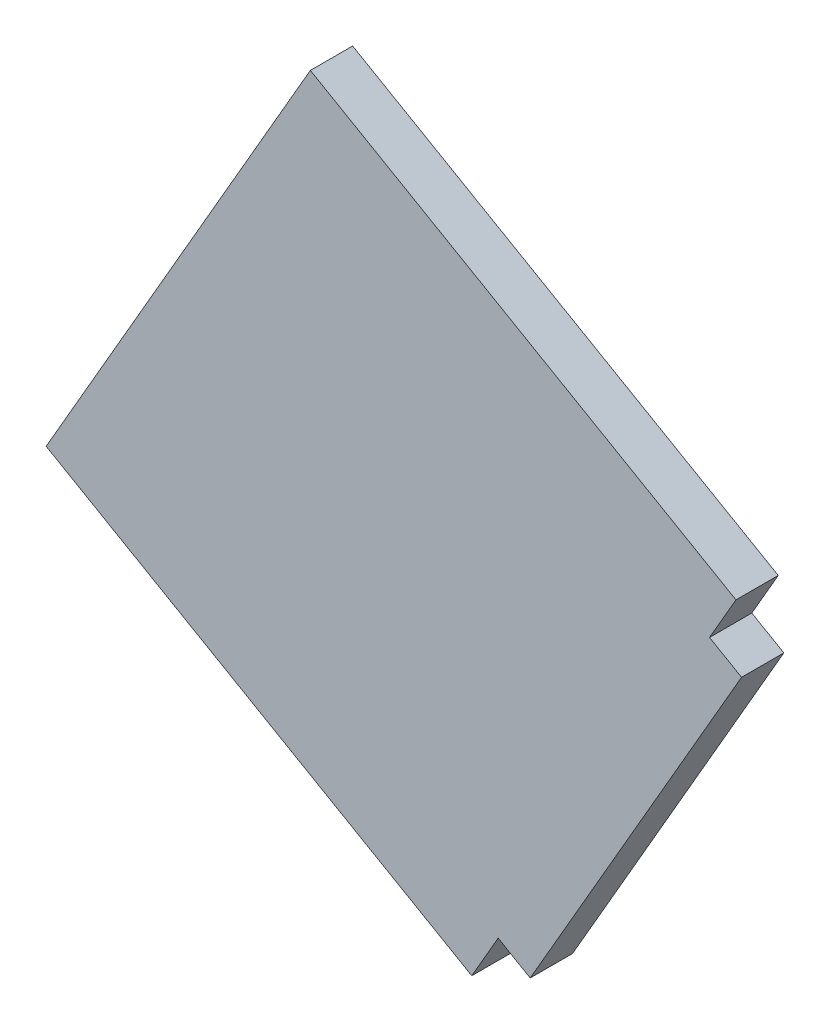
ISO-10303-21;
HEADER;
FILE_DESCRIPTION(('STEP AP214'),'2;1');
FILE_NAME('part.step','',(''),(''),'','','');
FILE_SCHEMA(('AUTOMOTIVE_DESIGN { 1 0 10303 214 1 1 1 1 }'));
ENDSEC;
DATA;
#1=APPLICATION_CONTEXT('core data for automotive mechanical design processes');
#2=APPLICATION_PROTOCOL_DEFINITION('international standard','automotive_design',2000,#1);
#3=PRODUCT_CONTEXT('',#1,'mechanical');
#4=PRODUCT('Part','Part','',(#3));
#5=PRODUCT_RELATED_PRODUCT_CATEGORY('part','',(#4));
#6=PRODUCT_DEFINITION_FORMATION('','',#4);
#7=PRODUCT_DEFINITION_CONTEXT('part definition',#1,'design');
#8=PRODUCT_DEFINITION('design','',#6,#7);
#9=PRODUCT_DEFINITION_SHAPE('','',#8);
#10=(LENGTH_UNIT() NAMED_UNIT(*) SI_UNIT(.MILLI.,.METRE.));
#11=(NAMED_UNIT(*) PLANE_ANGLE_UNIT() SI_UNIT($,.RADIAN.));
#12=(NAMED_UNIT(*) SI_UNIT($,.STERADIAN.) SOLID_ANGLE_UNIT());
#13=UNCERTAINTY_MEASURE_WITH_UNIT(LENGTH_MEASURE(1.E-05),#10,'distance_accuracy_value','');
#14=(GEOMETRIC_REPRESENTATION_CONTEXT(3) GLOBAL_UNCERTAINTY_ASSIGNED_CONTEXT((#13)) GLOBAL_UNIT_ASSIGNED_CONTEXT((#10,
#11,#12)) REPRESENTATION_CONTEXT('',''));
#15=CARTESIAN_POINT('',(0.,0.,0.));
#16=DIRECTION('',(0.,0.,1.));
#17=DIRECTION('',(1.,0.,0.));
#18=AXIS2_PLACEMENT_3D('',#15,#16,#17);
#19=CARTESIAN_POINT('',(-0.810621778264911,0.468012701892219,0.));
#20=DIRECTION('',(-0.866025403784439,0.5,0.));
#21=DIRECTION('',(-0.5,-0.866025403784439,0.));
#22=AXIS2_PLACEMENT_3D('',#19,#20,#21);
#23=PLANE('',#22);
#24=DIRECTION('',(-0.5,-0.866025403784439,0.));
#25=VECTOR('',#24,1.);
#26=CARTESIAN_POINT('',(-0.810621778264911,0.468012701892219,0.08));
#27=LINE('',#26,#25);
#28=CARTESIAN_POINT('',(-0.56062177826491,0.901025403784439,0.08));
#29=VERTEX_POINT('',#28);
#30=CARTESIAN_POINT('',(-0.610621778264911,0.814422863405995,0.08));
#31=VERTEX_POINT('',#30);
#32=EDGE_CURVE('E132',#29,#31,#27,.T.);
#33=ORIENTED_EDGE('',*,*,#32,.T.);
#34=DIRECTION('',(0.,0.,1.));
#35=VECTOR('',#34,1.);
#36=CARTESIAN_POINT('',(-0.610621778264911,0.814422863405995,0.));
#37=LINE('',#36,#35);
#38=CARTESIAN_POINT('',(-0.610621778264911,0.814422863405995,0.));
#39=VERTEX_POINT('',#38);
#40=EDGE_CURVE('E11',#39,#31,#37,.T.);
#41=ORIENTED_EDGE('',*,*,#40,.F.);
#42=DIRECTION('',(-0.5,-0.866025403784439,0.));
#43=VECTOR('',#42,1.);
#44=CARTESIAN_POINT('',(-0.810621778264911,0.468012701892219,0.));
#45=LINE('',#44,#43);
#46=CARTESIAN_POINT('',(-0.56062177826491,0.901025403784439,0.));
#47=VERTEX_POINT('',#46);
#48=EDGE_CURVE('E53',#47,#39,#45,.T.);
#49=ORIENTED_EDGE('',*,*,#48,.F.);
#50=DIRECTION('',(0.,0.,1.));
#51=VECTOR('',#50,1.);
#52=CARTESIAN_POINT('',(-0.56062177826491,0.901025403784439,0.));
#53=LINE('',#52,#51);
#54=EDGE_CURVE('E38',#47,#29,#53,.T.);
#55=ORIENTED_EDGE('',*,*,#54,.T.);
#56=EDGE_LOOP('',(#33,#41,#49,#55));
#57=FACE_BOUND('',#56,.T.);
#58=ADVANCED_FACE('F35',(#57),#23,.F.);
#59=CARTESIAN_POINT('',(0.2,0.346410161513776,0.));
#60=DIRECTION('',(0.5,0.866025403784439,0.));
#61=DIRECTION('',(-0.866025403784439,0.5,0.));
#62=AXIS2_PLACEMENT_3D('',#59,#60,#61);
#63=PLANE('',#62);
#64=DIRECTION('',(-0.866025403784439,0.5,0.));
#65=VECTOR('',#64,1.);
#66=CARTESIAN_POINT('',(0.2,0.346410161513776,0.08));
#67=LINE('',#66,#65);
#68=CARTESIAN_POINT('',(-0.55,0.779422863405995,0.08));
#69=VERTEX_POINT('',#68);
#70=EDGE_CURVE('E148',#69,#31,#67,.T.);
#71=ORIENTED_EDGE('',*,*,#70,.F.);
#72=DIRECTION('',(0.,0.,1.));
#73=VECTOR('',#72,1.);
#74=CARTESIAN_POINT('',(-0.55,0.779422863405995,0.));
#75=LINE('',#74,#73);
#76=CARTESIAN_POINT('',(-0.55,0.779422863405995,0.));
#77=VERTEX_POINT('',#76);
#78=EDGE_CURVE('E44',#77,#69,#75,.T.);
#79=ORIENTED_EDGE('',*,*,#78,.F.);
#80=DIRECTION('',(-0.866025403784439,0.5,0.));
#81=VECTOR('',#80,1.);
#82=CARTESIAN_POINT('',(0.2,0.346410161513776,0.));
#83=LINE('',#82,#81);
#84=EDGE_CURVE('E112',#77,#39,#83,.T.);
#85=ORIENTED_EDGE('',*,*,#84,.T.);
#86=ORIENTED_EDGE('',*,*,#40,.T.);
#87=EDGE_LOOP('',(#71,#79,#85,#86));
#88=FACE_BOUND('',#87,.T.);
#89=ADVANCED_FACE('F176',(#88),#63,.T.);
#90=CARTESIAN_POINT('',(-0.75,0.433012701892219,0.));
#91=DIRECTION('',(-0.866025403784439,0.5,0.));
#92=DIRECTION('',(-0.5,-0.866025403784439,0.));
#93=AXIS2_PLACEMENT_3D('',#90,#91,#92);
#94=PLANE('',#93);
#95=DIRECTION('',(-0.5,-0.866025403784439,0.));
#96=VECTOR('',#95,1.);
#97=CARTESIAN_POINT('',(-0.75,0.433012701892219,0.08));
#98=LINE('',#97,#96);
#99=CARTESIAN_POINT('',(-0.95,0.0866025403784438,0.08));
#100=VERTEX_POINT('',#99);
#101=EDGE_CURVE('E117',#69,#100,#98,.T.);
#102=ORIENTED_EDGE('',*,*,#101,.T.);
#103=DIRECTION('',(0.,0.,1.));
#104=VECTOR('',#103,1.);
#105=CARTESIAN_POINT('',(-0.95,0.0866025403784438,0.));
#106=LINE('',#105,#104);
#107=CARTESIAN_POINT('',(-0.95,0.0866025403784438,0.));
#108=VERTEX_POINT('',#107);
#109=EDGE_CURVE('E115',#108,#100,#106,.T.);
#110=ORIENTED_EDGE('',*,*,#109,.F.);
#111=DIRECTION('',(-0.5,-0.866025403784439,0.));
#112=VECTOR('',#111,1.);
#113=CARTESIAN_POINT('',(-0.75,0.433012701892219,0.));
#114=LINE('',#113,#112);
#115=EDGE_CURVE('E105',#77,#108,#114,.T.);
#116=ORIENTED_EDGE('',*,*,#115,.F.);
#117=ORIENTED_EDGE('',*,*,#78,.T.);
#118=EDGE_LOOP('',(#102,#110,#116,#117));
#119=FACE_BOUND('',#118,.T.);
#120=ADVANCED_FACE('F116',(#119),#94,.F.);
#121=CARTESIAN_POINT('',(-0.199999999999999,-0.346410161513775,0.));
#122=DIRECTION('',(0.499999999999999,0.866025403784439,0.));
#123=DIRECTION('',(-0.866025403784439,0.499999999999999,0.));
#124=AXIS2_PLACEMENT_3D('',#121,#122,#123);
#125=PLANE('',#124);
#126=DIRECTION('',(-0.866025403784439,0.499999999999999,0.));
#127=VECTOR('',#126,1.);
#128=CARTESIAN_POINT('',(-0.199999999999999,-0.346410161513775,0.08));
#129=LINE('',#128,#127);
#130=CARTESIAN_POINT('',(-1.01062177826491,0.121602540378444,0.08));
#131=VERTEX_POINT('',#130);
#132=EDGE_CURVE('E145',#100,#131,#129,.T.);
#133=ORIENTED_EDGE('',*,*,#132,.T.);
#134=DIRECTION('',(0.,0.,1.));
#135=VECTOR('',#134,1.);
#136=CARTESIAN_POINT('',(-1.01062177826491,0.121602540378444,0.));
#137=LINE('',#136,#135);
#138=CARTESIAN_POINT('',(-1.01062177826491,0.121602540378444,0.));
#139=VERTEX_POINT('',#138);
#140=EDGE_CURVE('E121',#139,#131,#137,.T.);
#141=ORIENTED_EDGE('',*,*,#140,.F.);
#142=DIRECTION('',(-0.866025403784439,0.499999999999999,0.));
#143=VECTOR('',#142,1.);
#144=CARTESIAN_POINT('',(-0.199999999999999,-0.346410161513775,0.));
#145=LINE('',#144,#143);
#146=EDGE_CURVE('E110',#108,#139,#145,.T.);
#147=ORIENTED_EDGE('',*,*,#146,.F.);
#148=ORIENTED_EDGE('',*,*,#109,.T.);
#149=EDGE_LOOP('',(#133,#141,#147,#148));
#150=FACE_BOUND('',#149,.T.);
#151=ADVANCED_FACE('F123',(#150),#125,.F.);
#152=CARTESIAN_POINT('',(-0.810621778264911,0.468012701892219,0.));
#153=DIRECTION('',(0.866025403784439,-0.499999999999999,0.));
#154=DIRECTION('',(0.499999999999999,0.866025403784439,0.));
#155=AXIS2_PLACEMENT_3D('',#152,#153,#154);
#156=PLANE('',#155);
#157=DIRECTION('',(0.499999999999999,0.866025403784439,0.));
#158=VECTOR('',#157,1.);
#159=CARTESIAN_POINT('',(-0.810621778264911,0.468012701892219,0.08));
#160=LINE('',#159,#158);
#161=CARTESIAN_POINT('',(-1.06062177826491,0.035,0.08));
#162=VERTEX_POINT('',#161);
#163=EDGE_CURVE('E142',#162,#131,#160,.T.);
#164=ORIENTED_EDGE('',*,*,#163,.F.);
#165=DIRECTION('',(0.,0.,1.));
#166=VECTOR('',#165,1.);
#167=CARTESIAN_POINT('',(-1.06062177826491,0.035,0.));
#168=LINE('',#167,#166);
#169=CARTESIAN_POINT('',(-1.06062177826491,0.035,0.));
#170=VERTEX_POINT('',#169);
#171=EDGE_CURVE('E153',#170,#162,#168,.T.);
#172=ORIENTED_EDGE('',*,*,#171,.F.);
#173=DIRECTION('',(0.499999999999999,0.866025403784439,0.));
#174=VECTOR('',#173,1.);
#175=CARTESIAN_POINT('',(-0.810621778264911,0.468012701892219,0.));
#176=LINE('',#175,#174);
#177=EDGE_CURVE('E125',#170,#139,#176,.T.);
#178=ORIENTED_EDGE('',*,*,#177,.T.);
#179=ORIENTED_EDGE('',*,*,#140,.T.);
#180=EDGE_LOOP('',(#164,#172,#178,#179));
#181=FACE_BOUND('',#180,.T.);
#182=ADVANCED_FACE('F189',(#181),#156,.T.);
#183=CARTESIAN_POINT('',(-0.25,-0.433012701892219,0.));
#184=DIRECTION('',(0.5,0.866025403784439,0.));
#185=DIRECTION('',(-0.866025403784439,0.5,0.));
#186=AXIS2_PLACEMENT_3D('',#183,#184,#185);
#187=PLANE('',#186);
#188=DIRECTION('',(-0.866025403784439,0.5,0.));
#189=VECTOR('',#188,1.);
#190=CARTESIAN_POINT('',(-0.25,-0.433012701892219,0.08));
#191=LINE('',#190,#189);
#192=CARTESIAN_POINT('',(-1.86602540378444,0.5,0.08));
#193=VERTEX_POINT('',#192);
#194=EDGE_CURVE('E140',#162,#193,#191,.T.);
#195=ORIENTED_EDGE('',*,*,#194,.T.);
#196=DIRECTION('',(0.,0.,1.));
#197=VECTOR('',#196,1.);
#198=CARTESIAN_POINT('',(-1.86602540378444,0.5,0.));
#199=LINE('',#198,#197);
#200=CARTESIAN_POINT('',(-1.86602540378444,0.5,0.));
#201=VERTEX_POINT('',#200);
#202=EDGE_CURVE('E155',#201,#193,#199,.T.);
#203=ORIENTED_EDGE('',*,*,#202,.F.);
#204=DIRECTION('',(-0.866025403784439,0.5,0.));
#205=VECTOR('',#204,1.);
#206=CARTESIAN_POINT('',(-0.25,-0.433012701892219,0.));
#207=LINE('',#206,#205);
#208=EDGE_CURVE('E127',#170,#201,#207,.T.);
#209=ORIENTED_EDGE('',*,*,#208,.F.);
#210=ORIENTED_EDGE('',*,*,#171,.T.);
#211=EDGE_LOOP('',(#195,#203,#209,#210));
#212=FACE_BOUND('',#211,.T.);
#213=ADVANCED_FACE('F172',(#212),#187,.F.);
#214=CARTESIAN_POINT('',(-1.61602540378444,0.93301270189222,0.));
#215=DIRECTION('',(0.866025403784438,-0.5,0.));
#216=DIRECTION('',(0.5,0.866025403784439,0.));
#217=AXIS2_PLACEMENT_3D('',#214,#215,#216);
#218=PLANE('',#217);
#219=DIRECTION('',(0.5,0.866025403784438,0.));
#220=VECTOR('',#219,1.);
#221=CARTESIAN_POINT('',(-1.61602540378444,0.93301270189222,0.08));
#222=LINE('',#221,#220);
#223=CARTESIAN_POINT('',(-1.36602540378444,1.36602540378444,0.08));
#224=VERTEX_POINT('',#223);
#225=EDGE_CURVE('E137',#193,#224,#222,.T.);
#226=ORIENTED_EDGE('',*,*,#225,.T.);
#227=DIRECTION('',(0.,0.,1.));
#228=VECTOR('',#227,1.);
#229=CARTESIAN_POINT('',(-1.36602540378444,1.36602540378444,0.));
#230=LINE('',#229,#228);
#231=CARTESIAN_POINT('',(-1.36602540378444,1.36602540378444,0.));
#232=VERTEX_POINT('',#231);
#233=EDGE_CURVE('E157',#232,#224,#230,.T.);
#234=ORIENTED_EDGE('',*,*,#233,.F.);
#235=DIRECTION('',(0.5,0.866025403784438,0.));
#236=VECTOR('',#235,1.);
#237=CARTESIAN_POINT('',(-1.61602540378444,0.93301270189222,0.));
#238=LINE('',#237,#236);
#239=EDGE_CURVE('E202',#201,#232,#238,.T.);
#240=ORIENTED_EDGE('',*,*,#239,.F.);
#241=ORIENTED_EDGE('',*,*,#202,.T.);
#242=EDGE_LOOP('',(#226,#234,#240,#241));
#243=FACE_BOUND('',#242,.T.);
#244=ADVANCED_FACE('F166',(#243),#218,.F.);
#245=CARTESIAN_POINT('',(0.25,0.43301270189222,0.));
#246=DIRECTION('',(0.5,0.866025403784439,0.));
#247=DIRECTION('',(-0.866025403784439,0.5,0.));
#248=AXIS2_PLACEMENT_3D('',#245,#246,#247);
#249=PLANE('',#248);
#250=DIRECTION('',(-0.866025403784439,0.5,0.));
#251=VECTOR('',#250,1.);
#252=CARTESIAN_POINT('',(0.25,0.43301270189222,0.08));
#253=LINE('',#252,#251);
#254=EDGE_CURVE('E134',#29,#224,#253,.T.);
#255=ORIENTED_EDGE('',*,*,#254,.F.);
#256=ORIENTED_EDGE('',*,*,#54,.F.);
#257=DIRECTION('',(-0.866025403784439,0.5,0.));
#258=VECTOR('',#257,1.);
#259=CARTESIAN_POINT('',(0.25,0.43301270189222,0.));
#260=LINE('',#259,#258);
#261=EDGE_CURVE('E203',#47,#232,#260,.T.);
#262=ORIENTED_EDGE('',*,*,#261,.T.);
#263=ORIENTED_EDGE('',*,*,#233,.T.);
#264=EDGE_LOOP('',(#255,#256,#262,#263));
#265=FACE_BOUND('',#264,.T.);
#266=ADVANCED_FACE('F164',(#265),#249,.T.);
#267=CARTESIAN_POINT('',(0.,0.,0.));
#268=DIRECTION('',(0.,0.,1.));
#269=DIRECTION('',(1.,0.,0.));
#270=AXIS2_PLACEMENT_3D('',#267,#268,#269);
#271=PLANE('',#270);
#272=ORIENTED_EDGE('',*,*,#48,.T.);
#273=ORIENTED_EDGE('',*,*,#84,.F.);
#274=ORIENTED_EDGE('',*,*,#115,.T.);
#275=ORIENTED_EDGE('',*,*,#146,.T.);
#276=ORIENTED_EDGE('',*,*,#177,.F.);
#277=ORIENTED_EDGE('',*,*,#208,.T.);
#278=ORIENTED_EDGE('',*,*,#239,.T.);
#279=ORIENTED_EDGE('',*,*,#261,.F.);
#280=EDGE_LOOP('',(#272,#273,#274,#275,#276,#277,#278,#279));
#281=FACE_BOUND('',#280,.T.);
#282=ADVANCED_FACE('F107',(#281),#271,.F.);
#283=CARTESIAN_POINT('',(0.,0.,0.08));
#284=DIRECTION('',(0.,0.,1.));
#285=DIRECTION('',(1.,0.,0.));
#286=AXIS2_PLACEMENT_3D('',#283,#284,#285);
#287=PLANE('',#286);
#288=ORIENTED_EDGE('',*,*,#32,.F.);
#289=ORIENTED_EDGE('',*,*,#254,.T.);
#290=ORIENTED_EDGE('',*,*,#225,.F.);
#291=ORIENTED_EDGE('',*,*,#194,.F.);
#292=ORIENTED_EDGE('',*,*,#163,.T.);
#293=ORIENTED_EDGE('',*,*,#132,.F.);
#294=ORIENTED_EDGE('',*,*,#101,.F.);
#295=ORIENTED_EDGE('',*,*,#70,.T.);
#296=EDGE_LOOP('',(#288,#289,#290,#291,#292,#293,#294,#295));
#297=FACE_BOUND('',#296,.T.);
#298=ADVANCED_FACE('F162',(#297),#287,.T.);
#299=CLOSED_SHELL('',(#58,#89,#120,#151,#182,#213,#244,#266,#282,#298));
#300=MANIFOLD_SOLID_BREP('B2',#299);
#301=ADVANCED_BREP_SHAPE_REPRESENTATION('',(#18,#300),#14);
#302=SHAPE_DEFINITION_REPRESENTATION(#9,#301);
ENDSEC;
END-ISO-10303-21;
